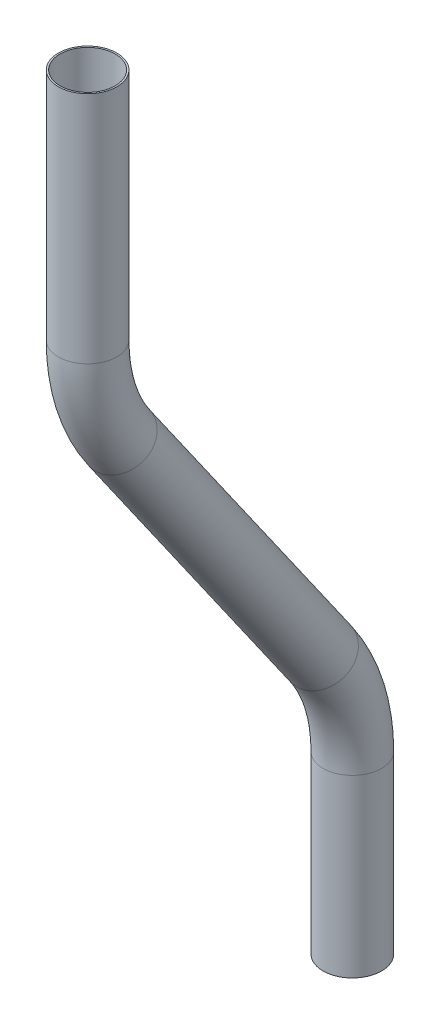
ISO-10303-21;
HEADER;
FILE_DESCRIPTION(('STEP AP214'),'2;1');
FILE_NAME('part.step','',(''),(''),'','','');
FILE_SCHEMA(('AUTOMOTIVE_DESIGN { 1 0 10303 214 1 1 1 1 }'));
ENDSEC;
DATA;
#1=APPLICATION_CONTEXT('core data for automotive mechanical design processes');
#2=APPLICATION_PROTOCOL_DEFINITION('international standard','automotive_design',2000,#1);
#3=PRODUCT_CONTEXT('',#1,'mechanical');
#4=PRODUCT('Part','Part','',(#3));
#5=PRODUCT_RELATED_PRODUCT_CATEGORY('part','',(#4));
#6=PRODUCT_DEFINITION_FORMATION('','',#4);
#7=PRODUCT_DEFINITION_CONTEXT('part definition',#1,'design');
#8=PRODUCT_DEFINITION('design','',#6,#7);
#9=PRODUCT_DEFINITION_SHAPE('','',#8);
#10=(LENGTH_UNIT() NAMED_UNIT(*) SI_UNIT(.MILLI.,.METRE.));
#11=(NAMED_UNIT(*) PLANE_ANGLE_UNIT() SI_UNIT($,.RADIAN.));
#12=(NAMED_UNIT(*) SI_UNIT($,.STERADIAN.) SOLID_ANGLE_UNIT());
#13=UNCERTAINTY_MEASURE_WITH_UNIT(LENGTH_MEASURE(1.E-05),#10,'distance_accuracy_value','');
#14=(GEOMETRIC_REPRESENTATION_CONTEXT(3) GLOBAL_UNCERTAINTY_ASSIGNED_CONTEXT((#13)) GLOBAL_UNIT_ASSIGNED_CONTEXT((#10,
#11,#12)) REPRESENTATION_CONTEXT('',''));
#15=CARTESIAN_POINT('',(0.,0.,0.));
#16=DIRECTION('',(0.,0.,1.));
#17=DIRECTION('',(1.,0.,0.));
#18=AXIS2_PLACEMENT_3D('',#15,#16,#17);
#19=CARTESIAN_POINT('',(0.,0.,0.));
#20=DIRECTION('',(0.,1.,0.));
#21=DIRECTION('',(0.,0.,1.));
#22=AXIS2_PLACEMENT_3D('',#19,#20,#21);
#23=CYLINDRICAL_SURFACE('',#22,6.35);
#24=CARTESIAN_POINT('',(0.,38.1,0.));
#25=DIRECTION('',(0.,1.,0.));
#26=DIRECTION('',(0.,0.,1.));
#27=AXIS2_PLACEMENT_3D('',#24,#25,#26);
#28=CIRCLE('',#27,6.35);
#29=CARTESIAN_POINT('',(0.,38.1,-6.35));
#30=VERTEX_POINT('',#29);
#31=EDGE_CURVE('E56',#30,#30,#28,.T.);
#32=ORIENTED_EDGE('',*,*,#31,.F.);
#33=EDGE_LOOP('',(#32));
#34=FACE_BOUND('',#33,.T.);
#35=CARTESIAN_POINT('',(0.,0.,0.));
#36=DIRECTION('',(0.,1.,0.));
#37=DIRECTION('',(0.,0.,1.));
#38=AXIS2_PLACEMENT_3D('',#35,#36,#37);
#39=CIRCLE('',#38,6.35);
#40=CARTESIAN_POINT('',(0.,0.,6.35));
#41=VERTEX_POINT('',#40);
#42=EDGE_CURVE('E53',#41,#41,#39,.T.);
#43=ORIENTED_EDGE('',*,*,#42,.T.);
#44=EDGE_LOOP('',(#43));
#45=FACE_BOUND('',#44,.T.);
#46=ADVANCED_FACE('F32',(#34,#45),#23,.T.);
#47=CARTESIAN_POINT('',(0.,38.1,38.1));
#48=DIRECTION('',(1.,0.,0.));
#49=DIRECTION('',(0.,0.,-1.));
#50=AXIS2_PLACEMENT_3D('',#47,#48,#49);
#51=TOROIDAL_SURFACE('',#50,38.1,6.35);
#52=CARTESIAN_POINT('',(0.,59.9532622249749,6.89030711258944));
#53=DIRECTION('',(0.,0.819152044288991,0.573576436351047));
#54=DIRECTION('',(0.,-0.573576436351047,0.819152044288991));
#55=AXIS2_PLACEMENT_3D('',#52,#53,#54);
#56=CIRCLE('',#55,6.35);
#57=CARTESIAN_POINT('',(0.,63.5954725958041,1.68869163135434));
#58=VERTEX_POINT('',#57);
#59=EDGE_CURVE('E59',#58,#58,#56,.T.);
#60=CARTESIAN_POINT('',(0.,38.1,38.1));
#61=DIRECTION('',(1.,0.,0.));
#62=DIRECTION('',(0.,0.,-1.));
#63=AXIS2_PLACEMENT_3D('',#60,#61,#62);
#64=CIRCLE('',#63,44.45);
#65=EDGE_CURVE('',#30,#58,#64,.T.);
#66=ORIENTED_EDGE('',*,*,#31,.T.);
#67=ORIENTED_EDGE('',*,*,#59,.F.);
#68=ORIENTED_EDGE('',*,*,#65,.T.);
#69=ORIENTED_EDGE('',*,*,#65,.F.);
#70=EDGE_LOOP('',(#66,#68,#67,#69));
#71=FACE_BOUND('',#70,.T.);
#72=ADVANCED_FACE('F78',(#71),#51,.T.);
#73=CARTESIAN_POINT('',(0.,59.9532622249749,6.89030711258943));
#74=DIRECTION('',(0.,0.819152044288991,0.573576436351047));
#75=DIRECTION('',(0.,-0.573576436351047,0.819152044288991));
#76=AXIS2_PLACEMENT_3D('',#73,#74,#75);
#77=CYLINDRICAL_SURFACE('',#76,6.35);
#78=CARTESIAN_POINT('',(0.,122.372647999796,50.5968315625392));
#79=DIRECTION('',(0.,0.819152044288991,0.573576436351047));
#80=DIRECTION('',(0.,-0.573576436351047,0.819152044288991));
#81=AXIS2_PLACEMENT_3D('',#78,#79,#80);
#82=CIRCLE('',#81,6.35);
#83=CARTESIAN_POINT('',(0.,118.730437628967,55.7984470437743));
#84=VERTEX_POINT('',#83);
#85=EDGE_CURVE('E61',#84,#84,#82,.T.);
#86=ORIENTED_EDGE('',*,*,#85,.F.);
#87=EDGE_LOOP('',(#86));
#88=FACE_BOUND('',#87,.T.);
#89=ORIENTED_EDGE('',*,*,#59,.T.);
#90=EDGE_LOOP('',(#89));
#91=FACE_BOUND('',#90,.T.);
#92=ADVANCED_FACE('F71',(#88,#91),#77,.T.);
#93=CARTESIAN_POINT('',(0.,144.225910224771,19.3871386751287));
#94=DIRECTION('',(-1.,0.,0.));
#95=DIRECTION('',(0.,0.,1.));
#96=AXIS2_PLACEMENT_3D('',#93,#94,#95);
#97=TOROIDAL_SURFACE('',#96,38.1,6.35);
#98=CARTESIAN_POINT('',(0.,144.225910224771,57.4871386751287));
#99=DIRECTION('',(0.,1.,0.));
#100=DIRECTION('',(0.,0.,1.));
#101=AXIS2_PLACEMENT_3D('',#98,#99,#100);
#102=CIRCLE('',#101,6.35);
#103=CARTESIAN_POINT('',(0.,144.225910224771,63.8371386751287));
#104=VERTEX_POINT('',#103);
#105=EDGE_CURVE('E36',#104,#104,#102,.T.);
#106=CARTESIAN_POINT('',(0.,144.225910224771,19.3871386751287));
#107=DIRECTION('',(-1.,0.,0.));
#108=DIRECTION('',(0.,0.,1.));
#109=AXIS2_PLACEMENT_3D('',#106,#107,#108);
#110=CIRCLE('',#109,44.45);
#111=EDGE_CURVE('',#84,#104,#110,.T.);
#112=ORIENTED_EDGE('',*,*,#85,.T.);
#113=ORIENTED_EDGE('',*,*,#105,.F.);
#114=ORIENTED_EDGE('',*,*,#111,.T.);
#115=ORIENTED_EDGE('',*,*,#111,.F.);
#116=EDGE_LOOP('',(#112,#114,#113,#115));
#117=FACE_BOUND('',#116,.T.);
#118=ADVANCED_FACE('F69',(#117),#97,.T.);
#119=CARTESIAN_POINT('',(0.,144.225910224771,57.4871386751287));
#120=DIRECTION('',(0.,1.,0.));
#121=DIRECTION('',(0.,0.,1.));
#122=AXIS2_PLACEMENT_3D('',#119,#120,#121);
#123=CYLINDRICAL_SURFACE('',#122,6.35);
#124=CARTESIAN_POINT('',(0.,195.025910224771,57.4871386751287));
#125=DIRECTION('',(0.,1.,0.));
#126=DIRECTION('',(0.,0.,1.));
#127=AXIS2_PLACEMENT_3D('',#124,#125,#126);
#128=CIRCLE('',#127,6.35);
#129=CARTESIAN_POINT('',(0.,195.025910224771,63.8371386751287));
#130=VERTEX_POINT('',#129);
#131=EDGE_CURVE('E49',#130,#130,#128,.T.);
#132=ORIENTED_EDGE('',*,*,#131,.F.);
#133=EDGE_LOOP('',(#132));
#134=FACE_BOUND('',#133,.T.);
#135=ORIENTED_EDGE('',*,*,#105,.T.);
#136=EDGE_LOOP('',(#135));
#137=FACE_BOUND('',#136,.T.);
#138=ADVANCED_FACE('F34',(#134,#137),#123,.T.);
#139=CARTESIAN_POINT('',(0.,0.,0.));
#140=DIRECTION('',(0.,1.,0.));
#141=DIRECTION('',(0.,0.,1.));
#142=AXIS2_PLACEMENT_3D('',#139,#140,#141);
#143=PLANE('',#142);
#144=CARTESIAN_POINT('',(0.,0.,0.));
#145=DIRECTION('',(0.,1.,0.));
#146=DIRECTION('',(0.,0.,1.));
#147=AXIS2_PLACEMENT_3D('',#144,#145,#146);
#148=CIRCLE('',#147,5.99576221123447);
#149=CARTESIAN_POINT('',(0.,0.,5.99576221123447));
#150=VERTEX_POINT('',#149);
#151=EDGE_CURVE('E52',#150,#150,#148,.F.);
#152=ORIENTED_EDGE('',*,*,#151,.F.);
#153=EDGE_LOOP('',(#152));
#154=FACE_BOUND('',#153,.T.);
#155=ORIENTED_EDGE('',*,*,#42,.F.);
#156=EDGE_LOOP('',(#155));
#157=FACE_BOUND('',#156,.T.);
#158=ADVANCED_FACE('F76',(#154,#157),#143,.F.);
#159=CARTESIAN_POINT('',(0.,195.025910224771,57.4871386751287));
#160=DIRECTION('',(0.,1.,0.));
#161=DIRECTION('',(0.,0.,1.));
#162=AXIS2_PLACEMENT_3D('',#159,#160,#161);
#163=PLANE('',#162);
#164=CARTESIAN_POINT('',(0.,195.025910224771,57.4871386751287));
#165=DIRECTION('',(0.,1.,0.));
#166=DIRECTION('',(0.,0.,1.));
#167=AXIS2_PLACEMENT_3D('',#164,#165,#166);
#168=CIRCLE('',#167,5.99576221123447);
#169=CARTESIAN_POINT('',(0.,195.025910224771,63.4829008863632));
#170=VERTEX_POINT('',#169);
#171=EDGE_CURVE('E10',#170,#170,#168,.F.);
#172=ORIENTED_EDGE('',*,*,#171,.T.);
#173=EDGE_LOOP('',(#172));
#174=FACE_BOUND('',#173,.T.);
#175=ORIENTED_EDGE('',*,*,#131,.T.);
#176=EDGE_LOOP('',(#175));
#177=FACE_BOUND('',#176,.T.);
#178=ADVANCED_FACE('F95',(#174,#177),#163,.T.);
#179=CARTESIAN_POINT('',(0.,0.,0.));
#180=DIRECTION('',(0.,1.,0.));
#181=DIRECTION('',(0.,0.,1.));
#182=AXIS2_PLACEMENT_3D('',#179,#180,#181);
#183=CYLINDRICAL_SURFACE('',#182,5.99576221123447);
#184=CARTESIAN_POINT('',(0.,38.1,0.));
#185=DIRECTION('',(0.,1.,0.));
#186=DIRECTION('',(0.,0.,1.));
#187=AXIS2_PLACEMENT_3D('',#184,#185,#186);
#188=CIRCLE('',#187,5.99576221123447);
#189=CARTESIAN_POINT('',(0.,38.1,-5.99576221123448));
#190=VERTEX_POINT('',#189);
#191=EDGE_CURVE('E191',#190,#190,#188,.F.);
#192=ORIENTED_EDGE('',*,*,#191,.F.);
#193=EDGE_LOOP('',(#192));
#194=FACE_BOUND('',#193,.T.);
#195=ORIENTED_EDGE('',*,*,#151,.T.);
#196=EDGE_LOOP('',(#195));
#197=FACE_BOUND('',#196,.T.);
#198=ADVANCED_FACE('F98',(#194,#197),#183,.F.);
#199=CARTESIAN_POINT('',(0.,38.1,38.1));
#200=DIRECTION('',(1.,0.,0.));
#201=DIRECTION('',(0.,0.,-1.));
#202=AXIS2_PLACEMENT_3D('',#199,#200,#201);
#203=TOROIDAL_SURFACE('',#202,38.1,5.99576221123447);
#204=CARTESIAN_POINT('',(0.,59.9532622249749,6.89030711258944));
#205=DIRECTION('',(0.,0.819152044288991,0.573576436351047));
#206=DIRECTION('',(0.,-0.573576436351047,0.819152044288991));
#207=AXIS2_PLACEMENT_3D('',#204,#205,#206);
#208=CIRCLE('',#207,5.99576221123447);
#209=CARTESIAN_POINT('',(0.,63.3922901473031,1.97886624018603));
#210=VERTEX_POINT('',#209);
#211=EDGE_CURVE('E190',#210,#210,#208,.F.);
#212=CARTESIAN_POINT('',(0.,38.1,38.1));
#213=DIRECTION('',(1.,0.,0.));
#214=DIRECTION('',(0.,0.,-1.));
#215=AXIS2_PLACEMENT_3D('',#212,#213,#214);
#216=CIRCLE('',#215,44.0957622112345);
#217=EDGE_CURVE('',#190,#210,#216,.T.);
#218=ORIENTED_EDGE('',*,*,#191,.T.);
#219=ORIENTED_EDGE('',*,*,#211,.F.);
#220=ORIENTED_EDGE('',*,*,#217,.T.);
#221=ORIENTED_EDGE('',*,*,#217,.F.);
#222=EDGE_LOOP('',(#218,#220,#219,#221));
#223=FACE_BOUND('',#222,.T.);
#224=ADVANCED_FACE('F153',(#223),#203,.F.);
#225=CARTESIAN_POINT('',(0.,59.9532622249749,6.89030711258943));
#226=DIRECTION('',(0.,0.819152044288991,0.573576436351047));
#227=DIRECTION('',(0.,-0.573576436351047,0.819152044288991));
#228=AXIS2_PLACEMENT_3D('',#225,#226,#227);
#229=CYLINDRICAL_SURFACE('',#228,5.99576221123447);
#230=CARTESIAN_POINT('',(0.,122.372647999796,50.5968315625392));
#231=DIRECTION('',(0.,0.819152044288991,0.573576436351047));
#232=DIRECTION('',(0.,-0.573576436351047,0.819152044288991));
#233=AXIS2_PLACEMENT_3D('',#230,#231,#232);
#234=CIRCLE('',#233,5.99576221123447);
#235=CARTESIAN_POINT('',(0.,118.933620077468,55.5082724349426));
#236=VERTEX_POINT('',#235);
#237=EDGE_CURVE('E45',#236,#236,#234,.F.);
#238=ORIENTED_EDGE('',*,*,#237,.F.);
#239=EDGE_LOOP('',(#238));
#240=FACE_BOUND('',#239,.T.);
#241=ORIENTED_EDGE('',*,*,#211,.T.);
#242=EDGE_LOOP('',(#241));
#243=FACE_BOUND('',#242,.T.);
#244=ADVANCED_FACE('F89',(#240,#243),#229,.F.);
#245=CARTESIAN_POINT('',(0.,144.225910224771,19.3871386751287));
#246=DIRECTION('',(-1.,0.,0.));
#247=DIRECTION('',(0.,0.,1.));
#248=AXIS2_PLACEMENT_3D('',#245,#246,#247);
#249=TOROIDAL_SURFACE('',#248,38.1,5.99576221123447);
#250=CARTESIAN_POINT('',(0.,144.225910224771,57.4871386751287));
#251=DIRECTION('',(0.,1.,0.));
#252=DIRECTION('',(0.,0.,1.));
#253=AXIS2_PLACEMENT_3D('',#250,#251,#252);
#254=CIRCLE('',#253,5.99576221123447);
#255=CARTESIAN_POINT('',(0.,144.225910224771,63.4829008863631));
#256=VERTEX_POINT('',#255);
#257=EDGE_CURVE('E40',#256,#256,#254,.F.);
#258=CARTESIAN_POINT('',(0.,144.225910224771,19.3871386751287));
#259=DIRECTION('',(-1.,0.,0.));
#260=DIRECTION('',(0.,0.,1.));
#261=AXIS2_PLACEMENT_3D('',#258,#259,#260);
#262=CIRCLE('',#261,44.0957622112345);
#263=EDGE_CURVE('',#236,#256,#262,.T.);
#264=ORIENTED_EDGE('',*,*,#237,.T.);
#265=ORIENTED_EDGE('',*,*,#257,.F.);
#266=ORIENTED_EDGE('',*,*,#263,.T.);
#267=ORIENTED_EDGE('',*,*,#263,.F.);
#268=EDGE_LOOP('',(#264,#266,#265,#267));
#269=FACE_BOUND('',#268,.T.);
#270=ADVANCED_FACE('F83',(#269),#249,.F.);
#271=CARTESIAN_POINT('',(0.,144.225910224771,57.4871386751287));
#272=DIRECTION('',(0.,1.,0.));
#273=DIRECTION('',(0.,0.,1.));
#274=AXIS2_PLACEMENT_3D('',#271,#272,#273);
#275=CYLINDRICAL_SURFACE('',#274,5.99576221123447);
#276=ORIENTED_EDGE('',*,*,#171,.F.);
#277=EDGE_LOOP('',(#276));
#278=FACE_BOUND('',#277,.T.);
#279=ORIENTED_EDGE('',*,*,#257,.T.);
#280=EDGE_LOOP('',(#279));
#281=FACE_BOUND('',#280,.T.);
#282=ADVANCED_FACE('F81',(#278,#281),#275,.F.);
#283=CLOSED_SHELL('',(#46,#72,#92,#118,#138,#158,#178,#198,#224,#244,#270,#282));
#284=MANIFOLD_SOLID_BREP('B2',#283);
#285=ADVANCED_BREP_SHAPE_REPRESENTATION('',(#18,#284),#14);
#286=SHAPE_DEFINITION_REPRESENTATION(#9,#285);
ENDSEC;
END-ISO-10303-21;
